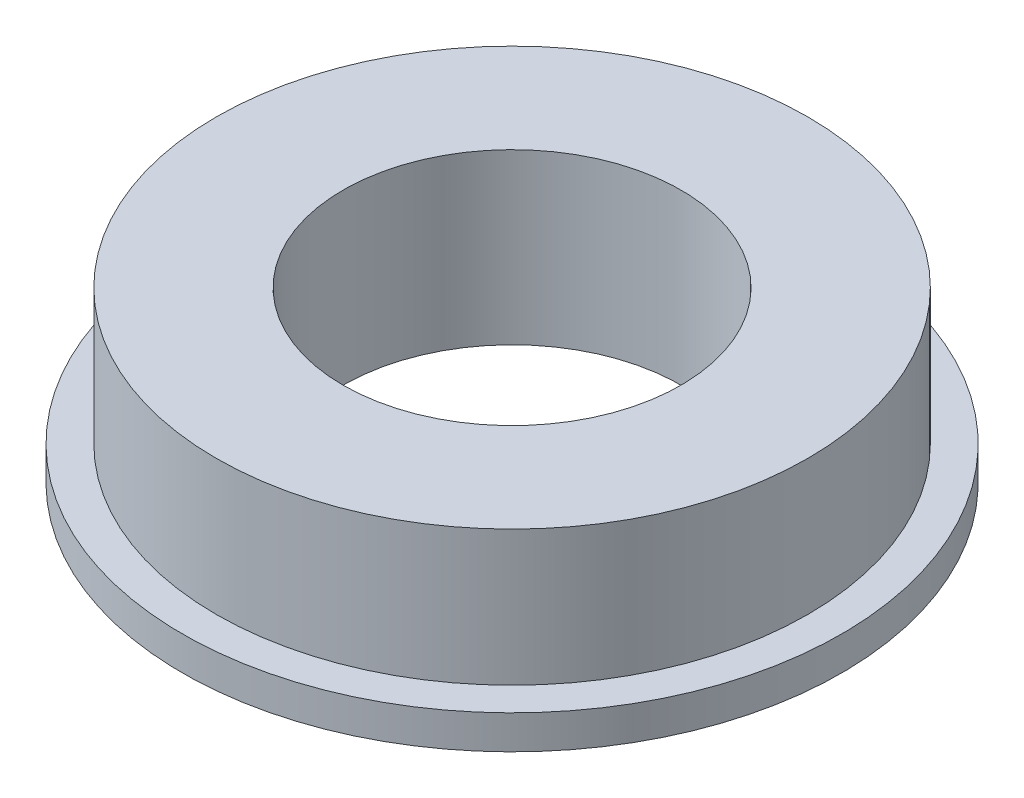
ISO-10303-21;
HEADER;
FILE_DESCRIPTION(('STEP AP214'),'2;1');
FILE_NAME('part.step','',(''),(''),'','','');
FILE_SCHEMA(('AUTOMOTIVE_DESIGN { 1 0 10303 214 1 1 1 1 }'));
ENDSEC;
DATA;
#1=APPLICATION_CONTEXT('core data for automotive mechanical design processes');
#2=APPLICATION_PROTOCOL_DEFINITION('international standard','automotive_design',2000,#1);
#3=PRODUCT_CONTEXT('',#1,'mechanical');
#4=PRODUCT('Part','Part','',(#3));
#5=PRODUCT_RELATED_PRODUCT_CATEGORY('part','',(#4));
#6=PRODUCT_DEFINITION_FORMATION('','',#4);
#7=PRODUCT_DEFINITION_CONTEXT('part definition',#1,'design');
#8=PRODUCT_DEFINITION('design','',#6,#7);
#9=PRODUCT_DEFINITION_SHAPE('','',#8);
#10=(LENGTH_UNIT() NAMED_UNIT(*) SI_UNIT(.MILLI.,.METRE.));
#11=(NAMED_UNIT(*) PLANE_ANGLE_UNIT() SI_UNIT($,.RADIAN.));
#12=(NAMED_UNIT(*) SI_UNIT($,.STERADIAN.) SOLID_ANGLE_UNIT());
#13=UNCERTAINTY_MEASURE_WITH_UNIT(LENGTH_MEASURE(1.E-05),#10,'distance_accuracy_value','');
#14=(GEOMETRIC_REPRESENTATION_CONTEXT(3) GLOBAL_UNCERTAINTY_ASSIGNED_CONTEXT((#13)) GLOBAL_UNIT_ASSIGNED_CONTEXT((#10,
#11,#12)) REPRESENTATION_CONTEXT('',''));
#15=CARTESIAN_POINT('',(0.,0.,0.));
#16=DIRECTION('',(0.,0.,1.));
#17=DIRECTION('',(1.,0.,0.));
#18=AXIS2_PLACEMENT_3D('',#15,#16,#17);
#19=CARTESIAN_POINT('',(0.,4.,0.));
#20=DIRECTION('',(0.,-1.,0.));
#21=DIRECTION('',(0.,0.,-1.));
#22=AXIS2_PLACEMENT_3D('',#19,#20,#21);
#23=CYLINDRICAL_SURFACE('',#22,7.);
#24=CARTESIAN_POINT('',(0.,4.,0.));
#25=DIRECTION('',(0.,1.,0.));
#26=DIRECTION('',(0.,0.,1.));
#27=AXIS2_PLACEMENT_3D('',#24,#25,#26);
#28=CIRCLE('',#27,7.);
#29=CARTESIAN_POINT('',(0.,4.,7.));
#30=VERTEX_POINT('',#29);
#31=EDGE_CURVE('E37',#30,#30,#28,.T.);
#32=ORIENTED_EDGE('',*,*,#31,.F.);
#33=EDGE_LOOP('',(#32));
#34=FACE_BOUND('',#33,.T.);
#35=CARTESIAN_POINT('',(0.,0.8,0.));
#36=DIRECTION('',(0.,-1.,0.));
#37=DIRECTION('',(0.,0.,-1.));
#38=AXIS2_PLACEMENT_3D('',#35,#36,#37);
#39=CIRCLE('',#38,7.);
#40=CARTESIAN_POINT('',(0.,0.8,-7.));
#41=VERTEX_POINT('',#40);
#42=EDGE_CURVE('E10',#41,#41,#39,.T.);
#43=ORIENTED_EDGE('',*,*,#42,.F.);
#44=EDGE_LOOP('',(#43));
#45=FACE_BOUND('',#44,.T.);
#46=ADVANCED_FACE('F34',(#34,#45),#23,.T.);
#47=CARTESIAN_POINT('',(0.,4.,0.));
#48=DIRECTION('',(0.,1.,0.));
#49=DIRECTION('',(0.,0.,1.));
#50=AXIS2_PLACEMENT_3D('',#47,#48,#49);
#51=PLANE('',#50);
#52=ORIENTED_EDGE('',*,*,#31,.T.);
#53=EDGE_LOOP('',(#52));
#54=FACE_BOUND('',#53,.T.);
#55=CARTESIAN_POINT('',(0.,4.,0.));
#56=DIRECTION('',(0.,1.,0.));
#57=DIRECTION('',(0.,0.,1.));
#58=AXIS2_PLACEMENT_3D('',#55,#56,#57);
#59=CIRCLE('',#58,4.);
#60=CARTESIAN_POINT('',(0.,4.,4.));
#61=VERTEX_POINT('',#60);
#62=EDGE_CURVE('E45',#61,#61,#59,.T.);
#63=ORIENTED_EDGE('',*,*,#62,.F.);
#64=EDGE_LOOP('',(#63));
#65=FACE_BOUND('',#64,.T.);
#66=ADVANCED_FACE('F76',(#54,#65),#51,.T.);
#67=CARTESIAN_POINT('',(0.,0.,0.));
#68=DIRECTION('',(0.,1.,0.));
#69=DIRECTION('',(0.,0.,1.));
#70=AXIS2_PLACEMENT_3D('',#67,#68,#69);
#71=PLANE('',#70);
#72=CARTESIAN_POINT('',(0.,0.,0.));
#73=DIRECTION('',(0.,1.,0.));
#74=DIRECTION('',(0.,0.,1.));
#75=AXIS2_PLACEMENT_3D('',#72,#73,#74);
#76=CIRCLE('',#75,4.);
#77=CARTESIAN_POINT('',(0.,0.,4.));
#78=VERTEX_POINT('',#77);
#79=EDGE_CURVE('E51',#78,#78,#76,.T.);
#80=ORIENTED_EDGE('',*,*,#79,.T.);
#81=EDGE_LOOP('',(#80));
#82=FACE_BOUND('',#81,.T.);
#83=CARTESIAN_POINT('',(0.,0.,0.));
#84=DIRECTION('',(0.,-1.,0.));
#85=DIRECTION('',(0.,0.,-1.));
#86=AXIS2_PLACEMENT_3D('',#83,#84,#85);
#87=CIRCLE('',#86,7.8);
#88=CARTESIAN_POINT('',(0.,0.,-7.8));
#89=VERTEX_POINT('',#88);
#90=EDGE_CURVE('E48',#89,#89,#87,.T.);
#91=ORIENTED_EDGE('',*,*,#90,.T.);
#92=EDGE_LOOP('',(#91));
#93=FACE_BOUND('',#92,.T.);
#94=ADVANCED_FACE('F62',(#82,#93),#71,.F.);
#95=CARTESIAN_POINT('',(0.,4.,0.));
#96=DIRECTION('',(0.,-1.,0.));
#97=DIRECTION('',(0.,0.,-1.));
#98=AXIS2_PLACEMENT_3D('',#95,#96,#97);
#99=CYLINDRICAL_SURFACE('',#98,4.);
#100=ORIENTED_EDGE('',*,*,#79,.F.);
#101=EDGE_LOOP('',(#100));
#102=FACE_BOUND('',#101,.T.);
#103=ORIENTED_EDGE('',*,*,#62,.T.);
#104=EDGE_LOOP('',(#103));
#105=FACE_BOUND('',#104,.T.);
#106=ADVANCED_FACE('F71',(#102,#105),#99,.F.);
#107=CARTESIAN_POINT('',(0.,0.8,0.));
#108=DIRECTION('',(0.,-1.,0.));
#109=DIRECTION('',(0.,0.,-1.));
#110=AXIS2_PLACEMENT_3D('',#107,#108,#109);
#111=PLANE('',#110);
#112=CARTESIAN_POINT('',(0.,0.8,0.));
#113=DIRECTION('',(0.,-1.,0.));
#114=DIRECTION('',(0.,0.,-1.));
#115=AXIS2_PLACEMENT_3D('',#112,#113,#114);
#116=CIRCLE('',#115,7.8);
#117=CARTESIAN_POINT('',(0.,0.8,-7.8));
#118=VERTEX_POINT('',#117);
#119=EDGE_CURVE('E53',#118,#118,#116,.T.);
#120=ORIENTED_EDGE('',*,*,#119,.F.);
#121=EDGE_LOOP('',(#120));
#122=FACE_BOUND('',#121,.T.);
#123=ORIENTED_EDGE('',*,*,#42,.T.);
#124=EDGE_LOOP('',(#123));
#125=FACE_BOUND('',#124,.T.);
#126=ADVANCED_FACE('F66',(#122,#125),#111,.F.);
#127=CARTESIAN_POINT('',(0.,0.8,0.));
#128=DIRECTION('',(0.,-1.,0.));
#129=DIRECTION('',(0.,0.,-1.));
#130=AXIS2_PLACEMENT_3D('',#127,#128,#129);
#131=CYLINDRICAL_SURFACE('',#130,7.8);
#132=ORIENTED_EDGE('',*,*,#119,.T.);
#133=EDGE_LOOP('',(#132));
#134=FACE_BOUND('',#133,.T.);
#135=ORIENTED_EDGE('',*,*,#90,.F.);
#136=EDGE_LOOP('',(#135));
#137=FACE_BOUND('',#136,.T.);
#138=ADVANCED_FACE('F64',(#134,#137),#131,.T.);
#139=CLOSED_SHELL('',(#46,#66,#94,#106,#126,#138));
#140=MANIFOLD_SOLID_BREP('B2',#139);
#141=ADVANCED_BREP_SHAPE_REPRESENTATION('',(#18,#140),#14);
#142=SHAPE_DEFINITION_REPRESENTATION(#9,#141);
ENDSEC;
END-ISO-10303-21;
